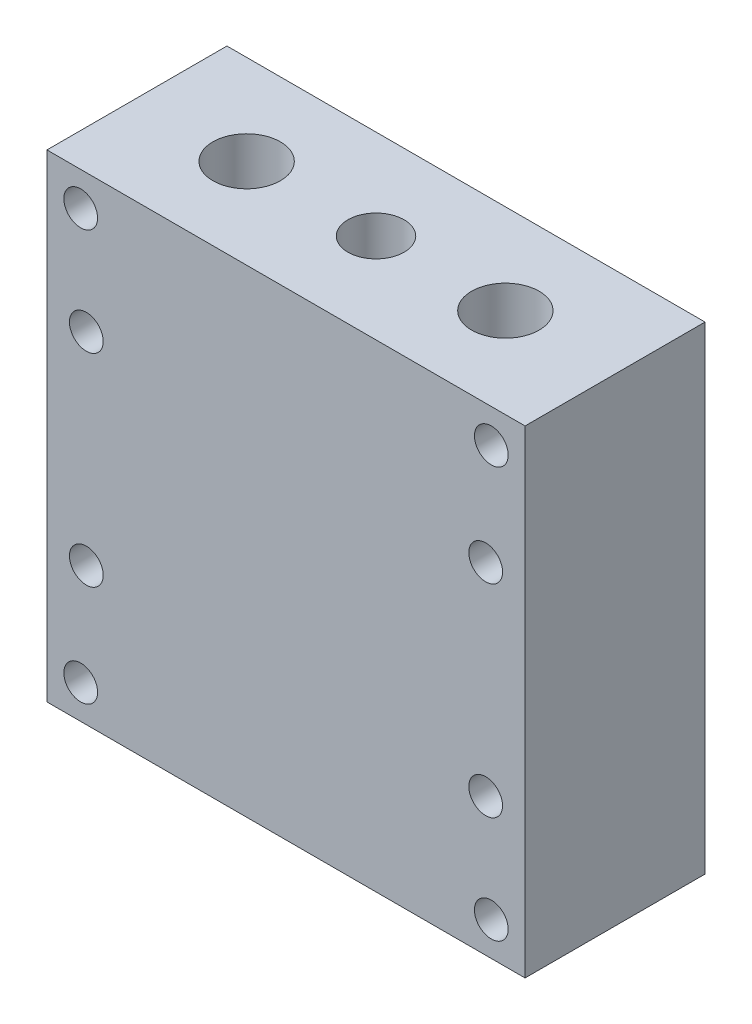
ISO-10303-21;
HEADER;
FILE_DESCRIPTION(('STEP AP214'),'2;1');
FILE_NAME('part.step','',(''),(''),'','','');
FILE_SCHEMA(('AUTOMOTIVE_DESIGN { 1 0 10303 214 1 1 1 1 }'));
ENDSEC;
DATA;
#1=APPLICATION_CONTEXT('core data for automotive mechanical design processes');
#2=APPLICATION_PROTOCOL_DEFINITION('international standard','automotive_design',2000,#1);
#3=PRODUCT_CONTEXT('',#1,'mechanical');
#4=PRODUCT('Part','Part','',(#3));
#5=PRODUCT_RELATED_PRODUCT_CATEGORY('part','',(#4));
#6=PRODUCT_DEFINITION_FORMATION('','',#4);
#7=PRODUCT_DEFINITION_CONTEXT('part definition',#1,'design');
#8=PRODUCT_DEFINITION('design','',#6,#7);
#9=PRODUCT_DEFINITION_SHAPE('','',#8);
#10=(LENGTH_UNIT() NAMED_UNIT(*) SI_UNIT(.MILLI.,.METRE.));
#11=(NAMED_UNIT(*) PLANE_ANGLE_UNIT() SI_UNIT($,.RADIAN.));
#12=(NAMED_UNIT(*) SI_UNIT($,.STERADIAN.) SOLID_ANGLE_UNIT());
#13=UNCERTAINTY_MEASURE_WITH_UNIT(LENGTH_MEASURE(1.E-05),#10,'distance_accuracy_value','');
#14=(GEOMETRIC_REPRESENTATION_CONTEXT(3) GLOBAL_UNCERTAINTY_ASSIGNED_CONTEXT((#13)) GLOBAL_UNIT_ASSIGNED_CONTEXT((#10,
#11,#12)) REPRESENTATION_CONTEXT('',''));
#15=CARTESIAN_POINT('',(0.,0.,0.));
#16=DIRECTION('',(0.,0.,1.));
#17=DIRECTION('',(1.,0.,0.));
#18=AXIS2_PLACEMENT_3D('',#15,#16,#17);
#19=CARTESIAN_POINT('',(42.5,-42.5,32.));
#20=DIRECTION('',(-1.,0.,0.));
#21=DIRECTION('',(0.,0.,1.));
#22=AXIS2_PLACEMENT_3D('',#19,#20,#21);
#23=PLANE('',#22);
#24=DIRECTION('',(0.,1.,0.));
#25=VECTOR('',#24,1.);
#26=CARTESIAN_POINT('',(42.5,-42.5,0.));
#27=LINE('',#26,#25);
#28=CARTESIAN_POINT('',(42.5,-42.5,0.));
#29=VERTEX_POINT('',#28);
#30=CARTESIAN_POINT('',(42.5,42.5,0.));
#31=VERTEX_POINT('',#30);
#32=EDGE_CURVE('E97',#29,#31,#27,.T.);
#33=ORIENTED_EDGE('',*,*,#32,.T.);
#34=DIRECTION('',(0.,0.,-1.));
#35=VECTOR('',#34,1.);
#36=CARTESIAN_POINT('',(42.5,42.5,32.));
#37=LINE('',#36,#35);
#38=CARTESIAN_POINT('',(42.5,42.5,32.));
#39=VERTEX_POINT('',#38);
#40=EDGE_CURVE('E11',#39,#31,#37,.T.);
#41=ORIENTED_EDGE('',*,*,#40,.F.);
#42=DIRECTION('',(0.,1.,0.));
#43=VECTOR('',#42,1.);
#44=CARTESIAN_POINT('',(42.5,-42.5,32.));
#45=LINE('',#44,#43);
#46=CARTESIAN_POINT('',(42.5,-42.5,32.));
#47=VERTEX_POINT('',#46);
#48=EDGE_CURVE('E85',#47,#39,#45,.T.);
#49=ORIENTED_EDGE('',*,*,#48,.F.);
#50=DIRECTION('',(0.,0.,-1.));
#51=VECTOR('',#50,1.);
#52=CARTESIAN_POINT('',(42.5,-42.5,32.));
#53=LINE('',#52,#51);
#54=EDGE_CURVE('E93',#47,#29,#53,.T.);
#55=ORIENTED_EDGE('',*,*,#54,.T.);
#56=EDGE_LOOP('',(#33,#41,#49,#55));
#57=FACE_BOUND('',#56,.T.);
#58=ADVANCED_FACE('F34',(#57),#23,.F.);
#59=CARTESIAN_POINT('',(-42.5,42.5,32.));
#60=DIRECTION('',(0.,-1.,0.));
#61=DIRECTION('',(0.,0.,-1.));
#62=AXIS2_PLACEMENT_3D('',#59,#60,#61);
#63=PLANE('',#62);
#64=CARTESIAN_POINT('',(23.,42.5,16.));
#65=DIRECTION('',(0.,1.,0.));
#66=DIRECTION('',(0.,0.,-1.));
#67=AXIS2_PLACEMENT_3D('',#64,#65,#66);
#68=CIRCLE('',#67,6.);
#69=CARTESIAN_POINT('',(23.,42.5,10.));
#70=VERTEX_POINT('',#69);
#71=EDGE_CURVE('E141',#70,#70,#68,.T.);
#72=ORIENTED_EDGE('',*,*,#71,.F.);
#73=EDGE_LOOP('',(#72));
#74=FACE_BOUND('',#73,.T.);
#75=CARTESIAN_POINT('',(-23.,42.5,16.));
#76=DIRECTION('',(0.,1.,0.));
#77=DIRECTION('',(0.,0.,1.));
#78=AXIS2_PLACEMENT_3D('',#75,#76,#77);
#79=CIRCLE('',#78,6.);
#80=CARTESIAN_POINT('',(-23.,42.5,22.));
#81=VERTEX_POINT('',#80);
#82=EDGE_CURVE('E148',#81,#81,#79,.T.);
#83=ORIENTED_EDGE('',*,*,#82,.F.);
#84=EDGE_LOOP('',(#83));
#85=FACE_BOUND('',#84,.T.);
#86=CARTESIAN_POINT('',(0.,42.5,16.));
#87=DIRECTION('',(0.,1.,0.));
#88=DIRECTION('',(0.,0.,1.));
#89=AXIS2_PLACEMENT_3D('',#86,#87,#88);
#90=CIRCLE('',#89,5.);
#91=CARTESIAN_POINT('',(0.,42.5,21.));
#92=VERTEX_POINT('',#91);
#93=EDGE_CURVE('E135',#92,#92,#90,.T.);
#94=ORIENTED_EDGE('',*,*,#93,.F.);
#95=EDGE_LOOP('',(#94));
#96=FACE_BOUND('',#95,.T.);
#97=DIRECTION('',(-1.,0.,0.));
#98=VECTOR('',#97,1.);
#99=CARTESIAN_POINT('',(-42.5,42.5,0.));
#100=LINE('',#99,#98);
#101=CARTESIAN_POINT('',(-42.5,42.5,0.));
#102=VERTEX_POINT('',#101);
#103=EDGE_CURVE('E89',#31,#102,#100,.T.);
#104=ORIENTED_EDGE('',*,*,#103,.T.);
#105=DIRECTION('',(0.,0.,-1.));
#106=VECTOR('',#105,1.);
#107=CARTESIAN_POINT('',(-42.5,42.5,32.));
#108=LINE('',#107,#106);
#109=CARTESIAN_POINT('',(-42.5,42.5,32.));
#110=VERTEX_POINT('',#109);
#111=EDGE_CURVE('E42',#110,#102,#108,.T.);
#112=ORIENTED_EDGE('',*,*,#111,.F.);
#113=DIRECTION('',(-1.,0.,0.));
#114=VECTOR('',#113,1.);
#115=CARTESIAN_POINT('',(-42.5,42.5,32.));
#116=LINE('',#115,#114);
#117=EDGE_CURVE('E80',#39,#110,#116,.T.);
#118=ORIENTED_EDGE('',*,*,#117,.F.);
#119=ORIENTED_EDGE('',*,*,#40,.T.);
#120=EDGE_LOOP('',(#104,#112,#118,#119));
#121=FACE_BOUND('',#120,.T.);
#122=ADVANCED_FACE('F88',(#74,#85,#96,#121),#63,.F.);
#123=CARTESIAN_POINT('',(-42.5,-42.5,32.));
#124=DIRECTION('',(1.,0.,0.));
#125=DIRECTION('',(0.,0.,-1.));
#126=AXIS2_PLACEMENT_3D('',#123,#124,#125);
#127=PLANE('',#126);
#128=DIRECTION('',(0.,-1.,0.));
#129=VECTOR('',#128,1.);
#130=CARTESIAN_POINT('',(-42.5,-42.5,0.));
#131=LINE('',#130,#129);
#132=CARTESIAN_POINT('',(-42.5,-42.5,0.));
#133=VERTEX_POINT('',#132);
#134=EDGE_CURVE('E67',#102,#133,#131,.T.);
#135=ORIENTED_EDGE('',*,*,#134,.T.);
#136=DIRECTION('',(0.,0.,-1.));
#137=VECTOR('',#136,1.);
#138=CARTESIAN_POINT('',(-42.5,-42.5,32.));
#139=LINE('',#138,#137);
#140=CARTESIAN_POINT('',(-42.5,-42.5,32.));
#141=VERTEX_POINT('',#140);
#142=EDGE_CURVE('E90',#141,#133,#139,.T.);
#143=ORIENTED_EDGE('',*,*,#142,.F.);
#144=DIRECTION('',(0.,-1.,0.));
#145=VECTOR('',#144,1.);
#146=CARTESIAN_POINT('',(-42.5,-42.5,32.));
#147=LINE('',#146,#145);
#148=EDGE_CURVE('E83',#110,#141,#147,.T.);
#149=ORIENTED_EDGE('',*,*,#148,.F.);
#150=ORIENTED_EDGE('',*,*,#111,.T.);
#151=EDGE_LOOP('',(#135,#143,#149,#150));
#152=FACE_BOUND('',#151,.T.);
#153=ADVANCED_FACE('F91',(#152),#127,.F.);
#154=CARTESIAN_POINT('',(-42.5,-42.5,32.));
#155=DIRECTION('',(0.,1.,0.));
#156=DIRECTION('',(0.,0.,1.));
#157=AXIS2_PLACEMENT_3D('',#154,#155,#156);
#158=PLANE('',#157);
#159=CARTESIAN_POINT('',(23.,-42.5,16.));
#160=DIRECTION('',(0.,1.,0.));
#161=DIRECTION('',(0.,0.,-1.));
#162=AXIS2_PLACEMENT_3D('',#159,#160,#161);
#163=CIRCLE('',#162,6.);
#164=CARTESIAN_POINT('',(23.,-42.5,10.));
#165=VERTEX_POINT('',#164);
#166=EDGE_CURVE('E144',#165,#165,#163,.T.);
#167=ORIENTED_EDGE('',*,*,#166,.T.);
#168=EDGE_LOOP('',(#167));
#169=FACE_BOUND('',#168,.T.);
#170=CARTESIAN_POINT('',(-23.,-42.5,16.));
#171=DIRECTION('',(0.,1.,0.));
#172=DIRECTION('',(0.,0.,1.));
#173=AXIS2_PLACEMENT_3D('',#170,#171,#172);
#174=CIRCLE('',#173,6.);
#175=CARTESIAN_POINT('',(-23.,-42.5,22.));
#176=VERTEX_POINT('',#175);
#177=EDGE_CURVE('E138',#176,#176,#174,.T.);
#178=ORIENTED_EDGE('',*,*,#177,.T.);
#179=EDGE_LOOP('',(#178));
#180=FACE_BOUND('',#179,.T.);
#181=CARTESIAN_POINT('',(0.,-42.5,16.));
#182=DIRECTION('',(0.,1.,0.));
#183=DIRECTION('',(0.,0.,1.));
#184=AXIS2_PLACEMENT_3D('',#181,#182,#183);
#185=CIRCLE('',#184,5.);
#186=CARTESIAN_POINT('',(0.,-42.5,21.));
#187=VERTEX_POINT('',#186);
#188=EDGE_CURVE('E121',#187,#187,#185,.T.);
#189=ORIENTED_EDGE('',*,*,#188,.T.);
#190=EDGE_LOOP('',(#189));
#191=FACE_BOUND('',#190,.T.);
#192=DIRECTION('',(1.,0.,0.));
#193=VECTOR('',#192,1.);
#194=CARTESIAN_POINT('',(-42.5,-42.5,0.));
#195=LINE('',#194,#193);
#196=EDGE_CURVE('E73',#133,#29,#195,.T.);
#197=ORIENTED_EDGE('',*,*,#196,.T.);
#198=ORIENTED_EDGE('',*,*,#54,.F.);
#199=DIRECTION('',(1.,0.,0.));
#200=VECTOR('',#199,1.);
#201=CARTESIAN_POINT('',(-42.5,-42.5,32.));
#202=LINE('',#201,#200);
#203=EDGE_CURVE('E50',#141,#47,#202,.T.);
#204=ORIENTED_EDGE('',*,*,#203,.F.);
#205=ORIENTED_EDGE('',*,*,#142,.T.);
#206=EDGE_LOOP('',(#197,#198,#204,#205));
#207=FACE_BOUND('',#206,.T.);
#208=ADVANCED_FACE('F105',(#169,#180,#191,#207),#158,.F.);
#209=CARTESIAN_POINT('',(0.,0.,32.));
#210=DIRECTION('',(0.,0.,-1.));
#211=DIRECTION('',(-1.,0.,0.));
#212=AXIS2_PLACEMENT_3D('',#209,#210,#211);
#213=PLANE('',#212);
#214=CARTESIAN_POINT('',(-35.5,18.,32.));
#215=DIRECTION('',(0.,0.,-1.));
#216=DIRECTION('',(1.,0.,0.));
#217=AXIS2_PLACEMENT_3D('',#214,#215,#216);
#218=CIRCLE('',#217,3.);
#219=CARTESIAN_POINT('',(-32.5,18.,32.));
#220=VERTEX_POINT('',#219);
#221=EDGE_CURVE('E162',#220,#220,#218,.T.);
#222=ORIENTED_EDGE('',*,*,#221,.T.);
#223=EDGE_LOOP('',(#222));
#224=FACE_BOUND('',#223,.T.);
#225=CARTESIAN_POINT('',(-35.5,-18.,32.));
#226=DIRECTION('',(0.,0.,-1.));
#227=DIRECTION('',(-1.,0.,0.));
#228=AXIS2_PLACEMENT_3D('',#225,#226,#227);
#229=CIRCLE('',#228,3.);
#230=CARTESIAN_POINT('',(-38.5,-18.,32.));
#231=VERTEX_POINT('',#230);
#232=EDGE_CURVE('E168',#231,#231,#229,.T.);
#233=ORIENTED_EDGE('',*,*,#232,.T.);
#234=EDGE_LOOP('',(#233));
#235=FACE_BOUND('',#234,.T.);
#236=CARTESIAN_POINT('',(35.5,-18.,32.));
#237=DIRECTION('',(0.,0.,-1.));
#238=DIRECTION('',(1.,0.,0.));
#239=AXIS2_PLACEMENT_3D('',#236,#237,#238);
#240=CIRCLE('',#239,3.);
#241=CARTESIAN_POINT('',(38.5,-18.,32.));
#242=VERTEX_POINT('',#241);
#243=EDGE_CURVE('E156',#242,#242,#240,.T.);
#244=ORIENTED_EDGE('',*,*,#243,.T.);
#245=EDGE_LOOP('',(#244));
#246=FACE_BOUND('',#245,.T.);
#247=CARTESIAN_POINT('',(35.5,18.,32.));
#248=DIRECTION('',(0.,0.,-1.));
#249=DIRECTION('',(-1.,0.,0.));
#250=AXIS2_PLACEMENT_3D('',#247,#248,#249);
#251=CIRCLE('',#250,3.);
#252=CARTESIAN_POINT('',(32.5,18.,32.));
#253=VERTEX_POINT('',#252);
#254=EDGE_CURVE('E145',#253,#253,#251,.T.);
#255=ORIENTED_EDGE('',*,*,#254,.T.);
#256=EDGE_LOOP('',(#255));
#257=FACE_BOUND('',#256,.T.);
#258=CARTESIAN_POINT('',(-36.5,-36.5,32.));
#259=DIRECTION('',(0.,0.,1.));
#260=DIRECTION('',(-1.,0.,0.));
#261=AXIS2_PLACEMENT_3D('',#258,#259,#260);
#262=CIRCLE('',#261,3.);
#263=CARTESIAN_POINT('',(-39.5,-36.5,32.));
#264=VERTEX_POINT('',#263);
#265=EDGE_CURVE('E117',#264,#264,#262,.T.);
#266=ORIENTED_EDGE('',*,*,#265,.F.);
#267=EDGE_LOOP('',(#266));
#268=FACE_BOUND('',#267,.T.);
#269=CARTESIAN_POINT('',(36.5,-36.5,32.));
#270=DIRECTION('',(0.,0.,1.));
#271=DIRECTION('',(1.,0.,0.));
#272=AXIS2_PLACEMENT_3D('',#269,#270,#271);
#273=CIRCLE('',#272,3.);
#274=CARTESIAN_POINT('',(39.5,-36.5,32.));
#275=VERTEX_POINT('',#274);
#276=EDGE_CURVE('E124',#275,#275,#273,.T.);
#277=ORIENTED_EDGE('',*,*,#276,.F.);
#278=EDGE_LOOP('',(#277));
#279=FACE_BOUND('',#278,.T.);
#280=CARTESIAN_POINT('',(36.5,36.5,32.));
#281=DIRECTION('',(0.,0.,1.));
#282=DIRECTION('',(-1.,0.,0.));
#283=AXIS2_PLACEMENT_3D('',#280,#281,#282);
#284=CIRCLE('',#283,3.);
#285=CARTESIAN_POINT('',(33.5,36.5,32.));
#286=VERTEX_POINT('',#285);
#287=EDGE_CURVE('E130',#286,#286,#284,.T.);
#288=ORIENTED_EDGE('',*,*,#287,.F.);
#289=EDGE_LOOP('',(#288));
#290=FACE_BOUND('',#289,.T.);
#291=CARTESIAN_POINT('',(-36.5,36.5,32.));
#292=DIRECTION('',(0.,0.,1.));
#293=DIRECTION('',(1.,0.,0.));
#294=AXIS2_PLACEMENT_3D('',#291,#292,#293);
#295=CIRCLE('',#294,3.);
#296=CARTESIAN_POINT('',(-33.5,36.5,32.));
#297=VERTEX_POINT('',#296);
#298=EDGE_CURVE('E111',#297,#297,#295,.T.);
#299=ORIENTED_EDGE('',*,*,#298,.F.);
#300=EDGE_LOOP('',(#299));
#301=FACE_BOUND('',#300,.T.);
#302=ORIENTED_EDGE('',*,*,#48,.T.);
#303=ORIENTED_EDGE('',*,*,#117,.T.);
#304=ORIENTED_EDGE('',*,*,#148,.T.);
#305=ORIENTED_EDGE('',*,*,#203,.T.);
#306=EDGE_LOOP('',(#302,#303,#304,#305));
#307=FACE_BOUND('',#306,.T.);
#308=ADVANCED_FACE('F81',(#224,#235,#246,#257,#268,#279,#290,#301,#307),#213,.F.);
#309=CARTESIAN_POINT('',(0.,0.,0.));
#310=DIRECTION('',(0.,0.,-1.));
#311=DIRECTION('',(-1.,0.,0.));
#312=AXIS2_PLACEMENT_3D('',#309,#310,#311);
#313=PLANE('',#312);
#314=CARTESIAN_POINT('',(-35.5,18.,0.));
#315=DIRECTION('',(0.,0.,-1.));
#316=DIRECTION('',(1.,0.,0.));
#317=AXIS2_PLACEMENT_3D('',#314,#315,#316);
#318=CIRCLE('',#317,3.);
#319=CARTESIAN_POINT('',(-32.5,18.,0.));
#320=VERTEX_POINT('',#319);
#321=EDGE_CURVE('E159',#320,#320,#318,.T.);
#322=ORIENTED_EDGE('',*,*,#321,.F.);
#323=EDGE_LOOP('',(#322));
#324=FACE_BOUND('',#323,.T.);
#325=CARTESIAN_POINT('',(-35.5,-18.,0.));
#326=DIRECTION('',(0.,0.,-1.));
#327=DIRECTION('',(-1.,0.,0.));
#328=AXIS2_PLACEMENT_3D('',#325,#326,#327);
#329=CIRCLE('',#328,3.);
#330=CARTESIAN_POINT('',(-38.5,-18.,0.));
#331=VERTEX_POINT('',#330);
#332=EDGE_CURVE('E165',#331,#331,#329,.T.);
#333=ORIENTED_EDGE('',*,*,#332,.F.);
#334=EDGE_LOOP('',(#333));
#335=FACE_BOUND('',#334,.T.);
#336=CARTESIAN_POINT('',(35.5,-18.,0.));
#337=DIRECTION('',(0.,0.,-1.));
#338=DIRECTION('',(1.,0.,0.));
#339=AXIS2_PLACEMENT_3D('',#336,#337,#338);
#340=CIRCLE('',#339,3.);
#341=CARTESIAN_POINT('',(38.5,-18.,0.));
#342=VERTEX_POINT('',#341);
#343=EDGE_CURVE('E171',#342,#342,#340,.T.);
#344=ORIENTED_EDGE('',*,*,#343,.F.);
#345=EDGE_LOOP('',(#344));
#346=FACE_BOUND('',#345,.T.);
#347=CARTESIAN_POINT('',(35.5,18.,0.));
#348=DIRECTION('',(0.,0.,-1.));
#349=DIRECTION('',(-1.,0.,0.));
#350=AXIS2_PLACEMENT_3D('',#347,#348,#349);
#351=CIRCLE('',#350,3.);
#352=CARTESIAN_POINT('',(32.5,18.,0.));
#353=VERTEX_POINT('',#352);
#354=EDGE_CURVE('E153',#353,#353,#351,.T.);
#355=ORIENTED_EDGE('',*,*,#354,.F.);
#356=EDGE_LOOP('',(#355));
#357=FACE_BOUND('',#356,.T.);
#358=CARTESIAN_POINT('',(-36.5,-36.5,0.));
#359=DIRECTION('',(0.,0.,1.));
#360=DIRECTION('',(-1.,0.,0.));
#361=AXIS2_PLACEMENT_3D('',#358,#359,#360);
#362=CIRCLE('',#361,3.);
#363=CARTESIAN_POINT('',(-39.5,-36.5,0.));
#364=VERTEX_POINT('',#363);
#365=EDGE_CURVE('E120',#364,#364,#362,.T.);
#366=ORIENTED_EDGE('',*,*,#365,.T.);
#367=EDGE_LOOP('',(#366));
#368=FACE_BOUND('',#367,.T.);
#369=CARTESIAN_POINT('',(36.5,-36.5,0.));
#370=DIRECTION('',(0.,0.,1.));
#371=DIRECTION('',(1.,0.,0.));
#372=AXIS2_PLACEMENT_3D('',#369,#370,#371);
#373=CIRCLE('',#372,3.);
#374=CARTESIAN_POINT('',(39.5,-36.5,0.));
#375=VERTEX_POINT('',#374);
#376=EDGE_CURVE('E127',#375,#375,#373,.T.);
#377=ORIENTED_EDGE('',*,*,#376,.T.);
#378=EDGE_LOOP('',(#377));
#379=FACE_BOUND('',#378,.T.);
#380=CARTESIAN_POINT('',(36.5,36.5,0.));
#381=DIRECTION('',(0.,0.,1.));
#382=DIRECTION('',(-1.,0.,0.));
#383=AXIS2_PLACEMENT_3D('',#380,#381,#382);
#384=CIRCLE('',#383,3.);
#385=CARTESIAN_POINT('',(33.5,36.5,0.));
#386=VERTEX_POINT('',#385);
#387=EDGE_CURVE('E114',#386,#386,#384,.T.);
#388=ORIENTED_EDGE('',*,*,#387,.T.);
#389=EDGE_LOOP('',(#388));
#390=FACE_BOUND('',#389,.T.);
#391=CARTESIAN_POINT('',(-36.5,36.5,0.));
#392=DIRECTION('',(0.,0.,1.));
#393=DIRECTION('',(1.,0.,0.));
#394=AXIS2_PLACEMENT_3D('',#391,#392,#393);
#395=CIRCLE('',#394,3.);
#396=CARTESIAN_POINT('',(-33.5,36.5,0.));
#397=VERTEX_POINT('',#396);
#398=EDGE_CURVE('E100',#397,#397,#395,.T.);
#399=ORIENTED_EDGE('',*,*,#398,.T.);
#400=EDGE_LOOP('',(#399));
#401=FACE_BOUND('',#400,.T.);
#402=ORIENTED_EDGE('',*,*,#32,.F.);
#403=ORIENTED_EDGE('',*,*,#196,.F.);
#404=ORIENTED_EDGE('',*,*,#134,.F.);
#405=ORIENTED_EDGE('',*,*,#103,.F.);
#406=EDGE_LOOP('',(#402,#403,#404,#405));
#407=FACE_BOUND('',#406,.T.);
#408=ADVANCED_FACE('F108',(#324,#335,#346,#357,#368,#379,#390,#401,#407),#313,.T.);
#409=CARTESIAN_POINT('',(-36.5,36.5,0.));
#410=DIRECTION('',(0.,0.,1.));
#411=DIRECTION('',(1.,0.,0.));
#412=AXIS2_PLACEMENT_3D('',#409,#410,#411);
#413=CYLINDRICAL_SURFACE('',#412,3.);
#414=ORIENTED_EDGE('',*,*,#398,.F.);
#415=EDGE_LOOP('',(#414));
#416=FACE_BOUND('',#415,.T.);
#417=ORIENTED_EDGE('',*,*,#298,.T.);
#418=EDGE_LOOP('',(#417));
#419=FACE_BOUND('',#418,.T.);
#420=ADVANCED_FACE('F189',(#416,#419),#413,.F.);
#421=CARTESIAN_POINT('',(36.5,36.5,0.));
#422=DIRECTION('',(0.,0.,1.));
#423=DIRECTION('',(1.,0.,0.));
#424=AXIS2_PLACEMENT_3D('',#421,#422,#423);
#425=CYLINDRICAL_SURFACE('',#424,3.);
#426=ORIENTED_EDGE('',*,*,#387,.F.);
#427=EDGE_LOOP('',(#426));
#428=FACE_BOUND('',#427,.T.);
#429=ORIENTED_EDGE('',*,*,#287,.T.);
#430=EDGE_LOOP('',(#429));
#431=FACE_BOUND('',#430,.T.);
#432=ADVANCED_FACE('F204',(#428,#431),#425,.F.);
#433=CARTESIAN_POINT('',(36.5,-36.5,0.));
#434=DIRECTION('',(0.,0.,1.));
#435=DIRECTION('',(1.,0.,0.));
#436=AXIS2_PLACEMENT_3D('',#433,#434,#435);
#437=CYLINDRICAL_SURFACE('',#436,3.);
#438=ORIENTED_EDGE('',*,*,#376,.F.);
#439=EDGE_LOOP('',(#438));
#440=FACE_BOUND('',#439,.T.);
#441=ORIENTED_EDGE('',*,*,#276,.T.);
#442=EDGE_LOOP('',(#441));
#443=FACE_BOUND('',#442,.T.);
#444=ADVANCED_FACE('F245',(#440,#443),#437,.F.);
#445=CARTESIAN_POINT('',(-36.5,-36.5,0.));
#446=DIRECTION('',(0.,0.,1.));
#447=DIRECTION('',(1.,0.,0.));
#448=AXIS2_PLACEMENT_3D('',#445,#446,#447);
#449=CYLINDRICAL_SURFACE('',#448,3.);
#450=ORIENTED_EDGE('',*,*,#365,.F.);
#451=EDGE_LOOP('',(#450));
#452=FACE_BOUND('',#451,.T.);
#453=ORIENTED_EDGE('',*,*,#265,.T.);
#454=EDGE_LOOP('',(#453));
#455=FACE_BOUND('',#454,.T.);
#456=ADVANCED_FACE('F235',(#452,#455),#449,.F.);
#457=CARTESIAN_POINT('',(0.,-42.5,16.));
#458=DIRECTION('',(0.,1.,0.));
#459=DIRECTION('',(0.,0.,1.));
#460=AXIS2_PLACEMENT_3D('',#457,#458,#459);
#461=CYLINDRICAL_SURFACE('',#460,5.);
#462=ORIENTED_EDGE('',*,*,#188,.F.);
#463=EDGE_LOOP('',(#462));
#464=FACE_BOUND('',#463,.T.);
#465=ORIENTED_EDGE('',*,*,#93,.T.);
#466=EDGE_LOOP('',(#465));
#467=FACE_BOUND('',#466,.T.);
#468=ADVANCED_FACE('F232',(#464,#467),#461,.F.);
#469=CARTESIAN_POINT('',(-23.,-42.5,16.));
#470=DIRECTION('',(0.,1.,0.));
#471=DIRECTION('',(0.,0.,1.));
#472=AXIS2_PLACEMENT_3D('',#469,#470,#471);
#473=CYLINDRICAL_SURFACE('',#472,6.);
#474=ORIENTED_EDGE('',*,*,#177,.F.);
#475=EDGE_LOOP('',(#474));
#476=FACE_BOUND('',#475,.T.);
#477=ORIENTED_EDGE('',*,*,#82,.T.);
#478=EDGE_LOOP('',(#477));
#479=FACE_BOUND('',#478,.T.);
#480=ADVANCED_FACE('F234',(#476,#479),#473,.F.);
#481=CARTESIAN_POINT('',(23.,-42.5,16.));
#482=DIRECTION('',(0.,1.,0.));
#483=DIRECTION('',(0.,0.,1.));
#484=AXIS2_PLACEMENT_3D('',#481,#482,#483);
#485=CYLINDRICAL_SURFACE('',#484,6.);
#486=ORIENTED_EDGE('',*,*,#166,.F.);
#487=EDGE_LOOP('',(#486));
#488=FACE_BOUND('',#487,.T.);
#489=ORIENTED_EDGE('',*,*,#71,.T.);
#490=EDGE_LOOP('',(#489));
#491=FACE_BOUND('',#490,.T.);
#492=ADVANCED_FACE('F242',(#488,#491),#485,.F.);
#493=CARTESIAN_POINT('',(35.5,18.,32.));
#494=DIRECTION('',(0.,0.,-1.));
#495=DIRECTION('',(-1.,0.,0.));
#496=AXIS2_PLACEMENT_3D('',#493,#494,#495);
#497=CYLINDRICAL_SURFACE('',#496,3.);
#498=ORIENTED_EDGE('',*,*,#254,.F.);
#499=EDGE_LOOP('',(#498));
#500=FACE_BOUND('',#499,.T.);
#501=ORIENTED_EDGE('',*,*,#354,.T.);
#502=EDGE_LOOP('',(#501));
#503=FACE_BOUND('',#502,.T.);
#504=ADVANCED_FACE('F183',(#500,#503),#497,.F.);
#505=CARTESIAN_POINT('',(35.5,-18.,32.));
#506=DIRECTION('',(0.,0.,-1.));
#507=DIRECTION('',(-1.,0.,0.));
#508=AXIS2_PLACEMENT_3D('',#505,#506,#507);
#509=CYLINDRICAL_SURFACE('',#508,3.);
#510=ORIENTED_EDGE('',*,*,#243,.F.);
#511=EDGE_LOOP('',(#510));
#512=FACE_BOUND('',#511,.T.);
#513=ORIENTED_EDGE('',*,*,#343,.T.);
#514=EDGE_LOOP('',(#513));
#515=FACE_BOUND('',#514,.T.);
#516=ADVANCED_FACE('F179',(#512,#515),#509,.F.);
#517=CARTESIAN_POINT('',(-35.5,-18.,32.));
#518=DIRECTION('',(0.,0.,-1.));
#519=DIRECTION('',(-1.,0.,0.));
#520=AXIS2_PLACEMENT_3D('',#517,#518,#519);
#521=CYLINDRICAL_SURFACE('',#520,3.);
#522=ORIENTED_EDGE('',*,*,#232,.F.);
#523=EDGE_LOOP('',(#522));
#524=FACE_BOUND('',#523,.T.);
#525=ORIENTED_EDGE('',*,*,#332,.T.);
#526=EDGE_LOOP('',(#525));
#527=FACE_BOUND('',#526,.T.);
#528=ADVANCED_FACE('F182',(#524,#527),#521,.F.);
#529=CARTESIAN_POINT('',(-35.5,18.,32.));
#530=DIRECTION('',(0.,0.,-1.));
#531=DIRECTION('',(-1.,0.,0.));
#532=AXIS2_PLACEMENT_3D('',#529,#530,#531);
#533=CYLINDRICAL_SURFACE('',#532,3.);
#534=ORIENTED_EDGE('',*,*,#221,.F.);
#535=EDGE_LOOP('',(#534));
#536=FACE_BOUND('',#535,.T.);
#537=ORIENTED_EDGE('',*,*,#321,.T.);
#538=EDGE_LOOP('',(#537));
#539=FACE_BOUND('',#538,.T.);
#540=ADVANCED_FACE('F335',(#536,#539),#533,.F.);
#541=CLOSED_SHELL('',(#58,#122,#153,#208,#308,#408,#420,#432,#444,#456,#468,#480,#492,#504,#516,
#528,#540));
#542=MANIFOLD_SOLID_BREP('B2',#541);
#543=ADVANCED_BREP_SHAPE_REPRESENTATION('',(#18,#542),#14);
#544=SHAPE_DEFINITION_REPRESENTATION(#9,#543);
ENDSEC;
END-ISO-10303-21;
